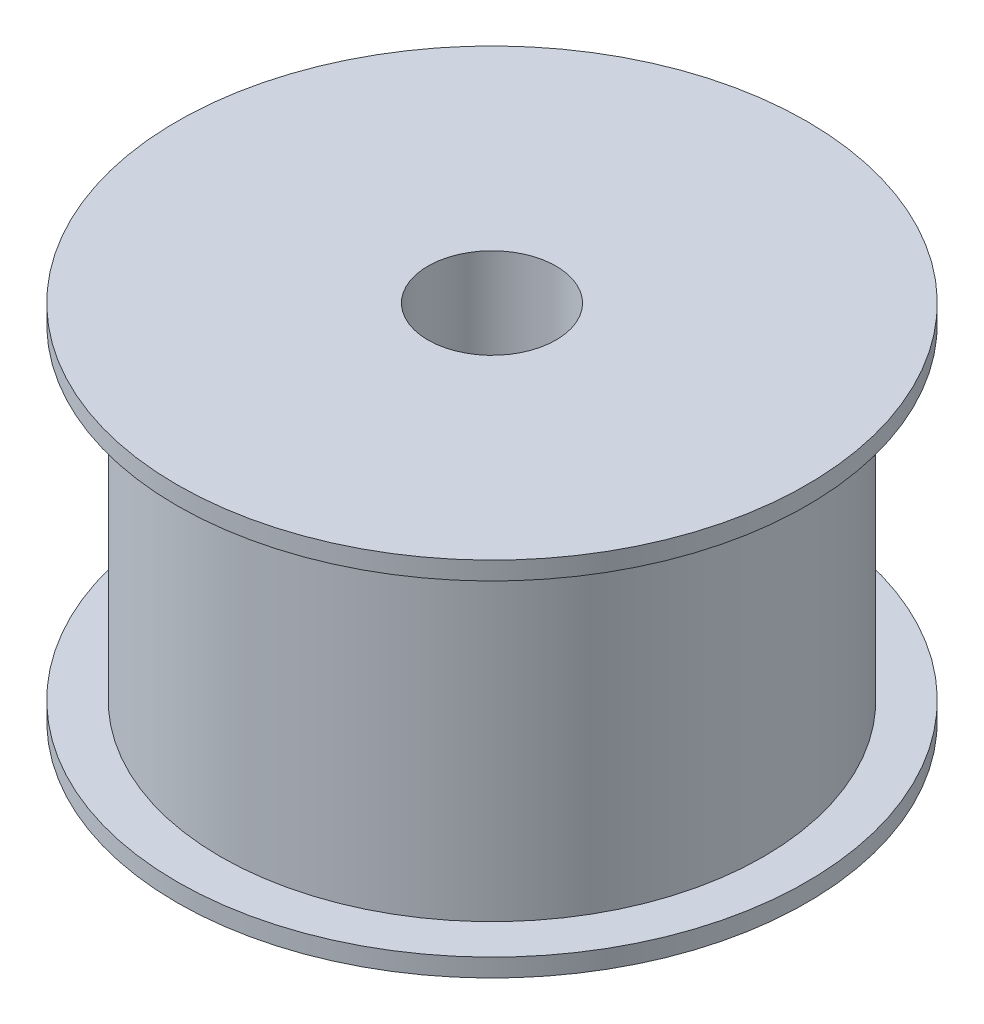
ISO-10303-21;
HEADER;
FILE_DESCRIPTION(('STEP AP214'),'2;1');
FILE_NAME('part.step','',(''),(''),'','','');
FILE_SCHEMA(('AUTOMOTIVE_DESIGN { 1 0 10303 214 1 1 1 1 }'));
ENDSEC;
DATA;
#1=APPLICATION_CONTEXT('core data for automotive mechanical design processes');
#2=APPLICATION_PROTOCOL_DEFINITION('international standard','automotive_design',2000,#1);
#3=PRODUCT_CONTEXT('',#1,'mechanical');
#4=PRODUCT('Part','Part','',(#3));
#5=PRODUCT_RELATED_PRODUCT_CATEGORY('part','',(#4));
#6=PRODUCT_DEFINITION_FORMATION('','',#4);
#7=PRODUCT_DEFINITION_CONTEXT('part definition',#1,'design');
#8=PRODUCT_DEFINITION('design','',#6,#7);
#9=PRODUCT_DEFINITION_SHAPE('','',#8);
#10=(LENGTH_UNIT() NAMED_UNIT(*) SI_UNIT(.MILLI.,.METRE.));
#11=(NAMED_UNIT(*) PLANE_ANGLE_UNIT() SI_UNIT($,.RADIAN.));
#12=(NAMED_UNIT(*) SI_UNIT($,.STERADIAN.) SOLID_ANGLE_UNIT());
#13=UNCERTAINTY_MEASURE_WITH_UNIT(LENGTH_MEASURE(1.E-05),#10,'distance_accuracy_value','');
#14=(GEOMETRIC_REPRESENTATION_CONTEXT(3) GLOBAL_UNCERTAINTY_ASSIGNED_CONTEXT((#13)) GLOBAL_UNIT_ASSIGNED_CONTEXT((#10,
#11,#12)) REPRESENTATION_CONTEXT('',''));
#15=CARTESIAN_POINT('',(0.,0.,0.));
#16=DIRECTION('',(0.,0.,1.));
#17=DIRECTION('',(1.,0.,0.));
#18=AXIS2_PLACEMENT_3D('',#15,#16,#17);
#19=CARTESIAN_POINT('',(0.,0.,0.));
#20=DIRECTION('',(0.,1.,0.));
#21=DIRECTION('',(0.,0.,1.));
#22=AXIS2_PLACEMENT_3D('',#19,#20,#21);
#23=CYLINDRICAL_SURFACE('',#22,11.049);
#24=CARTESIAN_POINT('',(0.,12.065,0.));
#25=DIRECTION('',(0.,1.,0.));
#26=DIRECTION('',(0.,0.,1.));
#27=AXIS2_PLACEMENT_3D('',#24,#25,#26);
#28=CIRCLE('',#27,11.049);
#29=CARTESIAN_POINT('',(0.,12.065,11.049));
#30=VERTEX_POINT('',#29);
#31=EDGE_CURVE('E57',#30,#30,#28,.T.);
#32=ORIENTED_EDGE('',*,*,#31,.T.);
#33=EDGE_LOOP('',(#32));
#34=FACE_BOUND('',#33,.T.);
#35=CARTESIAN_POINT('',(0.,12.7,0.));
#36=DIRECTION('',(0.,1.,0.));
#37=DIRECTION('',(0.,0.,1.));
#38=AXIS2_PLACEMENT_3D('',#35,#36,#37);
#39=CIRCLE('',#38,11.049);
#40=CARTESIAN_POINT('',(0.,12.7,11.049));
#41=VERTEX_POINT('',#40);
#42=EDGE_CURVE('E60',#41,#41,#39,.T.);
#43=ORIENTED_EDGE('',*,*,#42,.F.);
#44=EDGE_LOOP('',(#43));
#45=FACE_BOUND('',#44,.T.);
#46=ADVANCED_FACE('F37',(#34,#45),#23,.T.);
#47=CARTESIAN_POINT('',(0.,12.7,0.));
#48=DIRECTION('',(0.,1.,0.));
#49=DIRECTION('',(0.,0.,1.));
#50=AXIS2_PLACEMENT_3D('',#47,#48,#49);
#51=PLANE('',#50);
#52=CARTESIAN_POINT('',(0.,12.7,0.));
#53=DIRECTION('',(0.,1.,0.));
#54=DIRECTION('',(0.,0.,1.));
#55=AXIS2_PLACEMENT_3D('',#52,#53,#54);
#56=CIRCLE('',#55,2.2479);
#57=CARTESIAN_POINT('',(0.,12.7,2.2479));
#58=VERTEX_POINT('',#57);
#59=EDGE_CURVE('E66',#58,#58,#56,.T.);
#60=ORIENTED_EDGE('',*,*,#59,.F.);
#61=EDGE_LOOP('',(#60));
#62=FACE_BOUND('',#61,.T.);
#63=ORIENTED_EDGE('',*,*,#42,.T.);
#64=EDGE_LOOP('',(#63));
#65=FACE_BOUND('',#64,.T.);
#66=ADVANCED_FACE('F72',(#62,#65),#51,.T.);
#67=CARTESIAN_POINT('',(0.,12.065,0.));
#68=DIRECTION('',(0.,-1.,0.));
#69=DIRECTION('',(0.,0.,-1.));
#70=AXIS2_PLACEMENT_3D('',#67,#68,#69);
#71=PLANE('',#70);
#72=CARTESIAN_POINT('',(0.,12.065,0.));
#73=DIRECTION('',(0.,1.,0.));
#74=DIRECTION('',(0.,0.,1.));
#75=AXIS2_PLACEMENT_3D('',#72,#73,#74);
#76=CIRCLE('',#75,9.525);
#77=CARTESIAN_POINT('',(0.,12.065,9.525));
#78=VERTEX_POINT('',#77);
#79=EDGE_CURVE('E52',#78,#78,#76,.T.);
#80=ORIENTED_EDGE('',*,*,#79,.T.);
#81=EDGE_LOOP('',(#80));
#82=FACE_BOUND('',#81,.T.);
#83=ORIENTED_EDGE('',*,*,#31,.F.);
#84=EDGE_LOOP('',(#83));
#85=FACE_BOUND('',#84,.T.);
#86=ADVANCED_FACE('F75',(#82,#85),#71,.T.);
#87=CARTESIAN_POINT('',(0.,0.,0.));
#88=DIRECTION('',(0.,1.,0.));
#89=DIRECTION('',(0.,0.,1.));
#90=AXIS2_PLACEMENT_3D('',#87,#88,#89);
#91=CYLINDRICAL_SURFACE('',#90,9.525);
#92=CARTESIAN_POINT('',(0.,0.635,0.));
#93=DIRECTION('',(0.,1.,0.));
#94=DIRECTION('',(0.,0.,1.));
#95=AXIS2_PLACEMENT_3D('',#92,#93,#94);
#96=CIRCLE('',#95,9.525);
#97=CARTESIAN_POINT('',(0.,0.635,9.525));
#98=VERTEX_POINT('',#97);
#99=EDGE_CURVE('E48',#98,#98,#96,.T.);
#100=ORIENTED_EDGE('',*,*,#99,.T.);
#101=EDGE_LOOP('',(#100));
#102=FACE_BOUND('',#101,.T.);
#103=ORIENTED_EDGE('',*,*,#79,.F.);
#104=EDGE_LOOP('',(#103));
#105=FACE_BOUND('',#104,.T.);
#106=ADVANCED_FACE('F86',(#102,#105),#91,.T.);
#107=CARTESIAN_POINT('',(0.,0.635000000000001,0.));
#108=DIRECTION('',(0.,1.,0.));
#109=DIRECTION('',(0.,0.,1.));
#110=AXIS2_PLACEMENT_3D('',#107,#108,#109);
#111=PLANE('',#110);
#112=CARTESIAN_POINT('',(0.,0.635000000000001,0.));
#113=DIRECTION('',(0.,1.,0.));
#114=DIRECTION('',(0.,0.,1.));
#115=AXIS2_PLACEMENT_3D('',#112,#113,#114);
#116=CIRCLE('',#115,11.049);
#117=CARTESIAN_POINT('',(0.,0.635000000000001,11.049));
#118=VERTEX_POINT('',#117);
#119=EDGE_CURVE('E44',#118,#118,#116,.T.);
#120=ORIENTED_EDGE('',*,*,#119,.T.);
#121=EDGE_LOOP('',(#120));
#122=FACE_BOUND('',#121,.T.);
#123=ORIENTED_EDGE('',*,*,#99,.F.);
#124=EDGE_LOOP('',(#123));
#125=FACE_BOUND('',#124,.T.);
#126=ADVANCED_FACE('F91',(#122,#125),#111,.T.);
#127=CARTESIAN_POINT('',(0.,0.,0.));
#128=DIRECTION('',(0.,1.,0.));
#129=DIRECTION('',(0.,0.,1.));
#130=AXIS2_PLACEMENT_3D('',#127,#128,#129);
#131=CYLINDRICAL_SURFACE('',#130,11.049);
#132=CARTESIAN_POINT('',(0.,0.,0.));
#133=DIRECTION('',(0.,1.,0.));
#134=DIRECTION('',(0.,0.,1.));
#135=AXIS2_PLACEMENT_3D('',#132,#133,#134);
#136=CIRCLE('',#135,11.049);
#137=CARTESIAN_POINT('',(0.,0.,11.049));
#138=VERTEX_POINT('',#137);
#139=EDGE_CURVE('E10',#138,#138,#136,.T.);
#140=ORIENTED_EDGE('',*,*,#139,.T.);
#141=EDGE_LOOP('',(#140));
#142=FACE_BOUND('',#141,.T.);
#143=ORIENTED_EDGE('',*,*,#119,.F.);
#144=EDGE_LOOP('',(#143));
#145=FACE_BOUND('',#144,.T.);
#146=ADVANCED_FACE('F97',(#142,#145),#131,.T.);
#147=CARTESIAN_POINT('',(0.,0.,0.));
#148=DIRECTION('',(0.,-1.,0.));
#149=DIRECTION('',(0.,0.,-1.));
#150=AXIS2_PLACEMENT_3D('',#147,#148,#149);
#151=PLANE('',#150);
#152=CARTESIAN_POINT('',(0.,0.,0.));
#153=DIRECTION('',(0.,1.,0.));
#154=DIRECTION('',(0.,0.,1.));
#155=AXIS2_PLACEMENT_3D('',#152,#153,#154);
#156=CIRCLE('',#155,2.2479);
#157=CARTESIAN_POINT('',(0.,0.,2.2479));
#158=VERTEX_POINT('',#157);
#159=EDGE_CURVE('E63',#158,#158,#156,.T.);
#160=ORIENTED_EDGE('',*,*,#159,.T.);
#161=EDGE_LOOP('',(#160));
#162=FACE_BOUND('',#161,.T.);
#163=ORIENTED_EDGE('',*,*,#139,.F.);
#164=EDGE_LOOP('',(#163));
#165=FACE_BOUND('',#164,.T.);
#166=ADVANCED_FACE('F39',(#162,#165),#151,.T.);
#167=CARTESIAN_POINT('',(0.,12.7,0.));
#168=DIRECTION('',(0.,1.,0.));
#169=DIRECTION('',(0.,0.,1.));
#170=AXIS2_PLACEMENT_3D('',#167,#168,#169);
#171=CYLINDRICAL_SURFACE('',#170,2.2479);
#172=ORIENTED_EDGE('',*,*,#159,.F.);
#173=EDGE_LOOP('',(#172));
#174=FACE_BOUND('',#173,.T.);
#175=ORIENTED_EDGE('',*,*,#59,.T.);
#176=EDGE_LOOP('',(#175));
#177=FACE_BOUND('',#176,.T.);
#178=ADVANCED_FACE('F70',(#174,#177),#171,.F.);
#179=CLOSED_SHELL('',(#46,#66,#86,#106,#126,#146,#166,#178));
#180=MANIFOLD_SOLID_BREP('B2',#179);
#181=ADVANCED_BREP_SHAPE_REPRESENTATION('',(#18,#180),#14);
#182=SHAPE_DEFINITION_REPRESENTATION(#9,#181);
ENDSEC;
END-ISO-10303-21;
